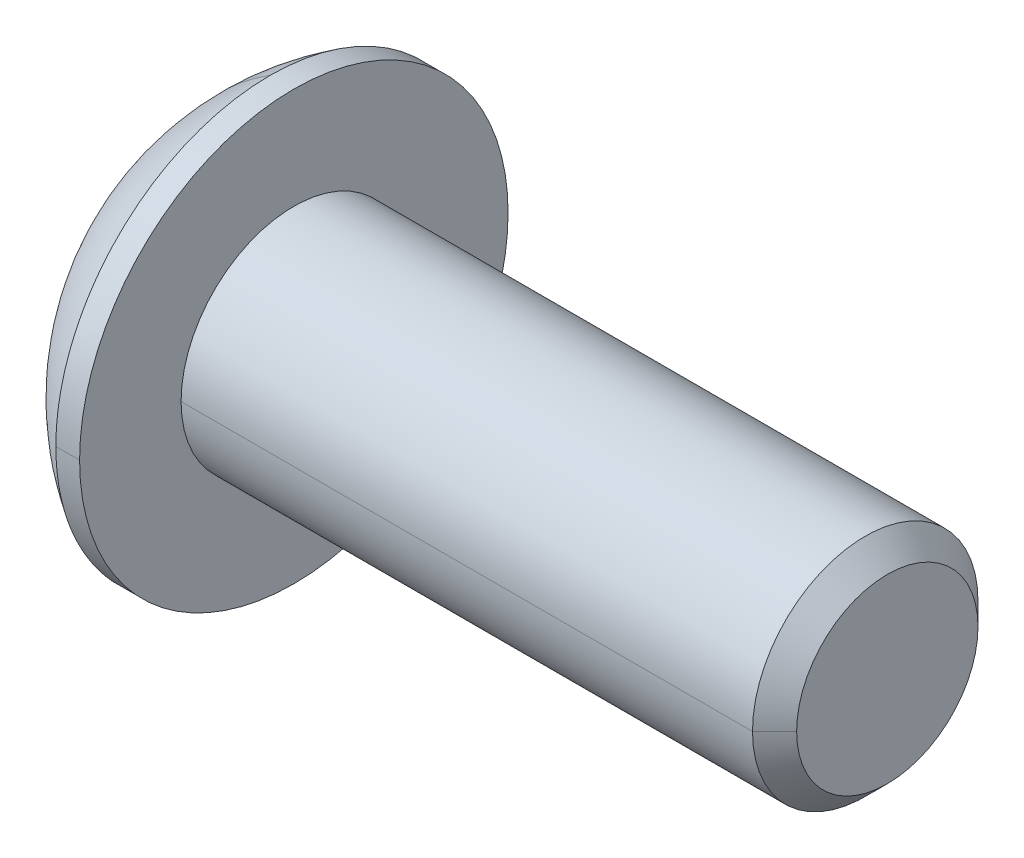
ISO-10303-21;
HEADER;
FILE_DESCRIPTION(('STEP AP214'),'2;1');
FILE_NAME('part.step','',(''),(''),'','','');
FILE_SCHEMA(('AUTOMOTIVE_DESIGN { 1 0 10303 214 1 1 1 1 }'));
ENDSEC;
DATA;
#1=APPLICATION_CONTEXT('core data for automotive mechanical design processes');
#2=APPLICATION_PROTOCOL_DEFINITION('international standard','automotive_design',2000,#1);
#3=PRODUCT_CONTEXT('',#1,'mechanical');
#4=PRODUCT('Part','Part','',(#3));
#5=PRODUCT_RELATED_PRODUCT_CATEGORY('part','',(#4));
#6=PRODUCT_DEFINITION_FORMATION('','',#4);
#7=PRODUCT_DEFINITION_CONTEXT('part definition',#1,'design');
#8=PRODUCT_DEFINITION('design','',#6,#7);
#9=PRODUCT_DEFINITION_SHAPE('','',#8);
#10=(LENGTH_UNIT() NAMED_UNIT(*) SI_UNIT(.MILLI.,.METRE.));
#11=(NAMED_UNIT(*) PLANE_ANGLE_UNIT() SI_UNIT($,.RADIAN.));
#12=(NAMED_UNIT(*) SI_UNIT($,.STERADIAN.) SOLID_ANGLE_UNIT());
#13=UNCERTAINTY_MEASURE_WITH_UNIT(LENGTH_MEASURE(1.E-05),#10,'distance_accuracy_value','');
#14=(GEOMETRIC_REPRESENTATION_CONTEXT(3) GLOBAL_UNCERTAINTY_ASSIGNED_CONTEXT((#13)) GLOBAL_UNIT_ASSIGNED_CONTEXT((#10,
#11,#12)) REPRESENTATION_CONTEXT('',''));
#15=CARTESIAN_POINT('',(0.,0.,0.));
#16=DIRECTION('',(0.,0.,1.));
#17=DIRECTION('',(1.,0.,0.));
#18=AXIS2_PLACEMENT_3D('',#15,#16,#17);
#19=CARTESIAN_POINT('',(-997.305456447661,0.,0.));
#20=DIRECTION('',(-1.,0.,0.));
#21=DIRECTION('',(0.,0.,1.));
#22=AXIS2_PLACEMENT_3D('',#19,#20,#21);
#23=CONICAL_SURFACE('',#22,1732.05080756885,1.0471975511966);
#24=DIRECTION('',(-0.5,0.,0.866025403784436));
#25=VECTOR('',#24,1.);
#26=CARTESIAN_POINT('',(2.69454355233854,0.,0.));
#27=LINE('',#26,#25);
#28=CARTESIAN_POINT('',(2.69454355233854,0.,0.));
#29=VERTEX_POINT('',#28);
#30=CARTESIAN_POINT('',(1.778,0.,1.5875));
#31=VERTEX_POINT('',#30);
#32=EDGE_CURVE('E41',#29,#31,#27,.T.);
#33=ORIENTED_EDGE('',*,*,#32,.F.);
#34=DIRECTION('',(-0.5,0.,-0.866025403784436));
#35=VECTOR('',#34,1.);
#36=CARTESIAN_POINT('',(2.69454355233854,0.,0.));
#37=LINE('',#36,#35);
#38=CARTESIAN_POINT('',(1.778,0.,-1.5875));
#39=VERTEX_POINT('',#38);
#40=EDGE_CURVE('E11',#29,#39,#37,.T.);
#41=ORIENTED_EDGE('',*,*,#40,.T.);
#42=CARTESIAN_POINT('',(1.778,0.,0.));
#43=DIRECTION('',(-1.,0.,0.));
#44=DIRECTION('',(0.,0.,1.));
#45=AXIS2_PLACEMENT_3D('',#42,#43,#44);
#46=CIRCLE('',#45,1.5875);
#47=CARTESIAN_POINT('',(1.778,-1.3748153285078,-0.79375));
#48=VERTEX_POINT('',#47);
#49=EDGE_CURVE('E27',#39,#48,#46,.T.);
#50=ORIENTED_EDGE('',*,*,#49,.T.);
#51=CARTESIAN_POINT('',(1.778,0.,0.));
#52=DIRECTION('',(-1.,0.,0.));
#53=DIRECTION('',(0.,0.,1.));
#54=AXIS2_PLACEMENT_3D('',#51,#52,#53);
#55=CIRCLE('',#54,1.5875);
#56=CARTESIAN_POINT('',(1.778,-1.3748153285078,0.79375));
#57=VERTEX_POINT('',#56);
#58=EDGE_CURVE('E178',#48,#57,#55,.T.);
#59=ORIENTED_EDGE('',*,*,#58,.T.);
#60=CARTESIAN_POINT('',(1.778,0.,0.));
#61=DIRECTION('',(-1.,0.,0.));
#62=DIRECTION('',(0.,0.,1.));
#63=AXIS2_PLACEMENT_3D('',#60,#61,#62);
#64=CIRCLE('',#63,1.5875);
#65=EDGE_CURVE('E176',#57,#31,#64,.T.);
#66=ORIENTED_EDGE('',*,*,#65,.T.);
#67=EDGE_LOOP('',(#33,#41,#50,#59,#66));
#68=FACE_BOUND('',#67,.T.);
#69=ADVANCED_FACE('F16',(#68),#23,.F.);
#70=CARTESIAN_POINT('',(15.2654,0.,0.));
#71=DIRECTION('',(-1.,0.,0.));
#72=DIRECTION('',(0.,0.,1.));
#73=AXIS2_PLACEMENT_3D('',#70,#71,#72);
#74=CONICAL_SURFACE('',#73,1.94056,0.785398163397452);
#75=CARTESIAN_POINT('',(15.2654,0.,0.));
#76=DIRECTION('',(-1.,0.,0.));
#77=DIRECTION('',(0.,0.,1.));
#78=AXIS2_PLACEMENT_3D('',#75,#76,#77);
#79=CIRCLE('',#78,1.94056);
#80=CARTESIAN_POINT('',(15.2654,0.,1.94056));
#81=VERTEX_POINT('',#80);
#82=CARTESIAN_POINT('',(15.2654,0.,-1.94056));
#83=VERTEX_POINT('',#82);
#84=EDGE_CURVE('E179',#81,#83,#79,.T.);
#85=ORIENTED_EDGE('',*,*,#84,.T.);
#86=DIRECTION('',(-0.707106781186545,0.,-0.70710678118655));
#87=VECTOR('',#86,1.);
#88=CARTESIAN_POINT('',(15.2654,0.,-1.94056));
#89=LINE('',#88,#87);
#90=CARTESIAN_POINT('',(14.79296,0.,-2.413));
#91=VERTEX_POINT('',#90);
#92=EDGE_CURVE('E221',#83,#91,#89,.T.);
#93=ORIENTED_EDGE('',*,*,#92,.T.);
#94=CARTESIAN_POINT('',(14.79296,0.,0.));
#95=DIRECTION('',(-1.,0.,0.));
#96=DIRECTION('',(0.,0.,1.));
#97=AXIS2_PLACEMENT_3D('',#94,#95,#96);
#98=CIRCLE('',#97,2.413);
#99=CARTESIAN_POINT('',(14.79296,0.,2.413));
#100=VERTEX_POINT('',#99);
#101=EDGE_CURVE('E192',#100,#91,#98,.T.);
#102=ORIENTED_EDGE('',*,*,#101,.F.);
#103=DIRECTION('',(-0.707106781186545,0.,0.70710678118655));
#104=VECTOR('',#103,1.);
#105=CARTESIAN_POINT('',(15.2654,0.,1.94056));
#106=LINE('',#105,#104);
#107=EDGE_CURVE('E216',#81,#100,#106,.T.);
#108=ORIENTED_EDGE('',*,*,#107,.F.);
#109=EDGE_LOOP('',(#85,#93,#102,#108));
#110=FACE_BOUND('',#109,.T.);
#111=ADVANCED_FACE('F359',(#110),#74,.T.);
#112=CARTESIAN_POINT('',(0.,0.,0.));
#113=DIRECTION('',(-1.,0.,0.));
#114=DIRECTION('',(0.,0.,1.));
#115=AXIS2_PLACEMENT_3D('',#112,#113,#114);
#116=CYLINDRICAL_SURFACE('',#115,2.413);
#117=ORIENTED_EDGE('',*,*,#101,.T.);
#118=DIRECTION('',(-1.,0.,0.));
#119=VECTOR('',#118,1.);
#120=CARTESIAN_POINT('',(0.,0.,-2.413));
#121=LINE('',#120,#119);
#122=CARTESIAN_POINT('',(2.5654,0.,-2.413));
#123=VERTEX_POINT('',#122);
#124=EDGE_CURVE('E158',#91,#123,#121,.T.);
#125=ORIENTED_EDGE('',*,*,#124,.T.);
#126=CARTESIAN_POINT('',(2.5654,0.,0.));
#127=DIRECTION('',(-1.,0.,0.));
#128=DIRECTION('',(0.,0.,1.));
#129=AXIS2_PLACEMENT_3D('',#126,#127,#128);
#130=CIRCLE('',#129,2.413);
#131=CARTESIAN_POINT('',(2.5654,0.,2.413));
#132=VERTEX_POINT('',#131);
#133=EDGE_CURVE('E152',#132,#123,#130,.T.);
#134=ORIENTED_EDGE('',*,*,#133,.F.);
#135=DIRECTION('',(-1.,0.,0.));
#136=VECTOR('',#135,1.);
#137=CARTESIAN_POINT('',(0.,0.,2.413));
#138=LINE('',#137,#136);
#139=EDGE_CURVE('E215',#100,#132,#138,.T.);
#140=ORIENTED_EDGE('',*,*,#139,.F.);
#141=EDGE_LOOP('',(#117,#125,#134,#140));
#142=FACE_BOUND('',#141,.T.);
#143=ADVANCED_FACE('F758',(#142),#116,.T.);
#144=CARTESIAN_POINT('',(0.,0.,0.));
#145=DIRECTION('',(-1.,0.,0.));
#146=DIRECTION('',(0.,0.,1.));
#147=AXIS2_PLACEMENT_3D('',#144,#145,#146);
#148=CYLINDRICAL_SURFACE('',#147,4.5847);
#149=CARTESIAN_POINT('',(2.5654,0.,0.));
#150=DIRECTION('',(-1.,0.,0.));
#151=DIRECTION('',(0.,0.,1.));
#152=AXIS2_PLACEMENT_3D('',#149,#150,#151);
#153=CIRCLE('',#152,4.5847);
#154=CARTESIAN_POINT('',(2.5654,0.,4.5847));
#155=VERTEX_POINT('',#154);
#156=CARTESIAN_POINT('',(2.5654,0.,-4.5847));
#157=VERTEX_POINT('',#156);
#158=EDGE_CURVE('E142',#155,#157,#153,.T.);
#159=ORIENTED_EDGE('',*,*,#158,.T.);
#160=DIRECTION('',(-1.,0.,0.));
#161=VECTOR('',#160,1.);
#162=CARTESIAN_POINT('',(0.,0.,-4.5847));
#163=LINE('',#162,#161);
#164=CARTESIAN_POINT('',(2.0574,0.,-4.5847));
#165=VERTEX_POINT('',#164);
#166=EDGE_CURVE('E159',#157,#165,#163,.T.);
#167=ORIENTED_EDGE('',*,*,#166,.T.);
#168=CARTESIAN_POINT('',(2.0574,0.,0.));
#169=DIRECTION('',(-1.,0.,0.));
#170=DIRECTION('',(0.,0.,1.));
#171=AXIS2_PLACEMENT_3D('',#168,#169,#170);
#172=CIRCLE('',#171,4.5847);
#173=CARTESIAN_POINT('',(2.0574,4.5847,0.));
#174=VERTEX_POINT('',#173);
#175=EDGE_CURVE('E325',#174,#165,#172,.T.);
#176=ORIENTED_EDGE('',*,*,#175,.F.);
#177=CARTESIAN_POINT('',(2.0574,0.,0.));
#178=DIRECTION('',(-1.,0.,0.));
#179=DIRECTION('',(0.,0.,1.));
#180=AXIS2_PLACEMENT_3D('',#177,#178,#179);
#181=CIRCLE('',#180,4.5847);
#182=CARTESIAN_POINT('',(2.0574,0.,4.5847));
#183=VERTEX_POINT('',#182);
#184=EDGE_CURVE('E145',#183,#174,#181,.T.);
#185=ORIENTED_EDGE('',*,*,#184,.F.);
#186=DIRECTION('',(-1.,0.,0.));
#187=VECTOR('',#186,1.);
#188=CARTESIAN_POINT('',(0.,0.,4.5847));
#189=LINE('',#188,#187);
#190=EDGE_CURVE('E138',#155,#183,#189,.T.);
#191=ORIENTED_EDGE('',*,*,#190,.F.);
#192=EDGE_LOOP('',(#159,#167,#176,#185,#191));
#193=FACE_BOUND('',#192,.T.);
#194=ADVANCED_FACE('F140',(#193),#148,.T.);
#195=CARTESIAN_POINT('',(4.85989606481482,0.,0.));
#196=DIRECTION('',(0.,0.,-1.));
#197=DIRECTION('',(0.,1.,0.));
#198=AXIS2_PLACEMENT_3D('',#195,#196,#197);
#199=SPHERICAL_SURFACE('',#198,5.37340285883188);
#200=ORIENTED_EDGE('',*,*,#175,.T.);
#201=CARTESIAN_POINT('',(2.0574,0.,0.));
#202=DIRECTION('',(-1.,0.,0.));
#203=DIRECTION('',(0.,0.,1.));
#204=AXIS2_PLACEMENT_3D('',#201,#202,#203);
#205=CIRCLE('',#204,4.5847);
#206=CARTESIAN_POINT('',(2.0574,-4.5847,0.));
#207=VERTEX_POINT('',#206);
#208=EDGE_CURVE('E247',#165,#207,#205,.T.);
#209=ORIENTED_EDGE('',*,*,#208,.T.);
#210=CARTESIAN_POINT('',(4.85989606481482,0.,0.));
#211=DIRECTION('',(0.,0.,-1.));
#212=DIRECTION('',(0.,1.,0.));
#213=AXIS2_PLACEMENT_3D('',#210,#211,#212);
#214=CIRCLE('',#213,5.37340285883188);
#215=CARTESIAN_POINT('',(0.,-2.29235,0.));
#216=VERTEX_POINT('',#215);
#217=EDGE_CURVE('E244',#207,#216,#214,.T.);
#218=ORIENTED_EDGE('',*,*,#217,.T.);
#219=CARTESIAN_POINT('',(0.,0.,0.));
#220=DIRECTION('',(-1.,0.,0.));
#221=DIRECTION('',(0.,0.,1.));
#222=AXIS2_PLACEMENT_3D('',#219,#220,#221);
#223=CIRCLE('',#222,2.29235);
#224=CARTESIAN_POINT('',(0.,2.29235,0.));
#225=VERTEX_POINT('',#224);
#226=EDGE_CURVE('E248',#225,#216,#223,.T.);
#227=ORIENTED_EDGE('',*,*,#226,.F.);
#228=CARTESIAN_POINT('',(4.85989606481482,0.,0.));
#229=DIRECTION('',(0.,0.,1.));
#230=DIRECTION('',(1.,0.,0.));
#231=AXIS2_PLACEMENT_3D('',#228,#229,#230);
#232=CIRCLE('',#231,5.37340285883188);
#233=EDGE_CURVE('E164',#174,#225,#232,.T.);
#234=ORIENTED_EDGE('',*,*,#233,.F.);
#235=EDGE_LOOP('',(#200,#209,#218,#227,#234));
#236=FACE_BOUND('',#235,.T.);
#237=ADVANCED_FACE('F738',(#236),#199,.T.);
#238=CARTESIAN_POINT('',(0.,0.,0.));
#239=DIRECTION('',(-1.,0.,0.));
#240=DIRECTION('',(0.,0.,1.));
#241=AXIS2_PLACEMENT_3D('',#238,#239,#240);
#242=PLANE('',#241);
#243=ORIENTED_EDGE('',*,*,#226,.T.);
#244=CARTESIAN_POINT('',(0.,0.,0.));
#245=DIRECTION('',(-1.,0.,0.));
#246=DIRECTION('',(0.,0.,1.));
#247=AXIS2_PLACEMENT_3D('',#244,#245,#246);
#248=CIRCLE('',#247,2.29235);
#249=EDGE_CURVE('E315',#216,#225,#248,.T.);
#250=ORIENTED_EDGE('',*,*,#249,.T.);
#251=EDGE_LOOP('',(#243,#250));
#252=FACE_BOUND('',#251,.T.);
#253=DIRECTION('',(0.,-1.,0.));
#254=VECTOR('',#253,1.);
#255=CARTESIAN_POINT('',(0.,-0.916543552338531,1.5875));
#256=LINE('',#255,#254);
#257=CARTESIAN_POINT('',(0.,0.916543552338531,1.5875));
#258=VERTEX_POINT('',#257);
#259=CARTESIAN_POINT('',(0.,-0.916543552338531,1.5875));
#260=VERTEX_POINT('',#259);
#261=EDGE_CURVE('E301',#258,#260,#256,.T.);
#262=ORIENTED_EDGE('',*,*,#261,.T.);
#263=DIRECTION('',(0.,-0.5,-0.866025403784439));
#264=VECTOR('',#263,1.);
#265=CARTESIAN_POINT('',(0.,-1.83308710467706,0.));
#266=LINE('',#265,#264);
#267=CARTESIAN_POINT('',(0.,-1.83308710467706,0.));
#268=VERTEX_POINT('',#267);
#269=EDGE_CURVE('E297',#260,#268,#266,.T.);
#270=ORIENTED_EDGE('',*,*,#269,.T.);
#271=DIRECTION('',(0.,0.5,-0.866025403784439));
#272=VECTOR('',#271,1.);
#273=CARTESIAN_POINT('',(0.,-0.916543552338531,-1.5875));
#274=LINE('',#273,#272);
#275=CARTESIAN_POINT('',(0.,-0.916543552338531,-1.5875));
#276=VERTEX_POINT('',#275);
#277=EDGE_CURVE('E228',#268,#276,#274,.T.);
#278=ORIENTED_EDGE('',*,*,#277,.T.);
#279=DIRECTION('',(0.,1.,0.));
#280=VECTOR('',#279,1.);
#281=CARTESIAN_POINT('',(0.,0.916543552338531,-1.5875));
#282=LINE('',#281,#280);
#283=CARTESIAN_POINT('',(0.,0.916543552338531,-1.5875));
#284=VERTEX_POINT('',#283);
#285=EDGE_CURVE('E197',#276,#284,#282,.T.);
#286=ORIENTED_EDGE('',*,*,#285,.T.);
#287=DIRECTION('',(0.,0.5,0.866025403784439));
#288=VECTOR('',#287,1.);
#289=CARTESIAN_POINT('',(0.,1.83308710467706,0.));
#290=LINE('',#289,#288);
#291=CARTESIAN_POINT('',(0.,1.83308710467706,0.));
#292=VERTEX_POINT('',#291);
#293=EDGE_CURVE('E193',#284,#292,#290,.T.);
#294=ORIENTED_EDGE('',*,*,#293,.T.);
#295=DIRECTION('',(0.,-0.5,0.866025403784439));
#296=VECTOR('',#295,1.);
#297=CARTESIAN_POINT('',(0.,0.916543552338531,1.5875));
#298=LINE('',#297,#296);
#299=EDGE_CURVE('E198',#292,#258,#298,.T.);
#300=ORIENTED_EDGE('',*,*,#299,.T.);
#301=EDGE_LOOP('',(#262,#270,#278,#286,#294,#300));
#302=FACE_BOUND('',#301,.T.);
#303=ADVANCED_FACE('F742',(#252,#302),#242,.T.);
#304=CARTESIAN_POINT('',(4.85989606481482,0.,0.));
#305=DIRECTION('',(0.,0.,-1.));
#306=DIRECTION('',(0.,1.,0.));
#307=AXIS2_PLACEMENT_3D('',#304,#305,#306);
#308=SPHERICAL_SURFACE('',#307,5.37340285883188);
#309=ORIENTED_EDGE('',*,*,#217,.F.);
#310=CARTESIAN_POINT('',(2.0574,0.,0.));
#311=DIRECTION('',(-1.,0.,0.));
#312=DIRECTION('',(0.,0.,1.));
#313=AXIS2_PLACEMENT_3D('',#310,#311,#312);
#314=CIRCLE('',#313,4.5847);
#315=EDGE_CURVE('E201',#207,#183,#314,.T.);
#316=ORIENTED_EDGE('',*,*,#315,.T.);
#317=ORIENTED_EDGE('',*,*,#184,.T.);
#318=ORIENTED_EDGE('',*,*,#233,.T.);
#319=ORIENTED_EDGE('',*,*,#249,.F.);
#320=EDGE_LOOP('',(#309,#316,#317,#318,#319));
#321=FACE_BOUND('',#320,.T.);
#322=ADVANCED_FACE('F790',(#321),#308,.T.);
#323=CARTESIAN_POINT('',(0.,0.,0.));
#324=DIRECTION('',(-1.,0.,0.));
#325=DIRECTION('',(0.,0.,1.));
#326=AXIS2_PLACEMENT_3D('',#323,#324,#325);
#327=CYLINDRICAL_SURFACE('',#326,4.5847);
#328=ORIENTED_EDGE('',*,*,#166,.F.);
#329=CARTESIAN_POINT('',(2.5654,0.,0.));
#330=DIRECTION('',(-1.,0.,0.));
#331=DIRECTION('',(0.,0.,1.));
#332=AXIS2_PLACEMENT_3D('',#329,#330,#331);
#333=CIRCLE('',#332,4.5847);
#334=EDGE_CURVE('E151',#157,#155,#333,.T.);
#335=ORIENTED_EDGE('',*,*,#334,.T.);
#336=ORIENTED_EDGE('',*,*,#190,.T.);
#337=ORIENTED_EDGE('',*,*,#315,.F.);
#338=ORIENTED_EDGE('',*,*,#208,.F.);
#339=EDGE_LOOP('',(#328,#335,#336,#337,#338));
#340=FACE_BOUND('',#339,.T.);
#341=ADVANCED_FACE('F161',(#340),#327,.T.);
#342=CARTESIAN_POINT('',(2.5654,2.413,0.));
#343=DIRECTION('',(-1.,0.,0.));
#344=DIRECTION('',(0.,0.,1.));
#345=AXIS2_PLACEMENT_3D('',#342,#343,#344);
#346=PLANE('',#345);
#347=ORIENTED_EDGE('',*,*,#158,.F.);
#348=ORIENTED_EDGE('',*,*,#334,.F.);
#349=EDGE_LOOP('',(#347,#348));
#350=FACE_BOUND('',#349,.T.);
#351=ORIENTED_EDGE('',*,*,#133,.T.);
#352=CARTESIAN_POINT('',(2.5654,0.,0.));
#353=DIRECTION('',(-1.,0.,0.));
#354=DIRECTION('',(0.,0.,1.));
#355=AXIS2_PLACEMENT_3D('',#352,#353,#354);
#356=CIRCLE('',#355,2.413);
#357=EDGE_CURVE('E229',#123,#132,#356,.T.);
#358=ORIENTED_EDGE('',*,*,#357,.T.);
#359=EDGE_LOOP('',(#351,#358));
#360=FACE_BOUND('',#359,.T.);
#361=ADVANCED_FACE('F155',(#350,#360),#346,.F.);
#362=CARTESIAN_POINT('',(0.,0.,0.));
#363=DIRECTION('',(-1.,0.,0.));
#364=DIRECTION('',(0.,0.,1.));
#365=AXIS2_PLACEMENT_3D('',#362,#363,#364);
#366=CYLINDRICAL_SURFACE('',#365,2.413);
#367=ORIENTED_EDGE('',*,*,#124,.F.);
#368=CARTESIAN_POINT('',(14.79296,0.,0.));
#369=DIRECTION('',(-1.,0.,0.));
#370=DIRECTION('',(0.,0.,1.));
#371=AXIS2_PLACEMENT_3D('',#368,#369,#370);
#372=CIRCLE('',#371,2.413);
#373=EDGE_CURVE('E233',#91,#100,#372,.T.);
#374=ORIENTED_EDGE('',*,*,#373,.T.);
#375=ORIENTED_EDGE('',*,*,#139,.T.);
#376=ORIENTED_EDGE('',*,*,#357,.F.);
#377=EDGE_LOOP('',(#367,#374,#375,#376));
#378=FACE_BOUND('',#377,.T.);
#379=ADVANCED_FACE('F813',(#378),#366,.T.);
#380=CARTESIAN_POINT('',(15.2654,0.,0.));
#381=DIRECTION('',(-1.,0.,0.));
#382=DIRECTION('',(0.,0.,1.));
#383=AXIS2_PLACEMENT_3D('',#380,#381,#382);
#384=CONICAL_SURFACE('',#383,1.94056,0.785398163397452);
#385=ORIENTED_EDGE('',*,*,#92,.F.);
#386=CARTESIAN_POINT('',(15.2654,0.,0.));
#387=DIRECTION('',(-1.,0.,0.));
#388=DIRECTION('',(0.,0.,1.));
#389=AXIS2_PLACEMENT_3D('',#386,#387,#388);
#390=CIRCLE('',#389,1.94056);
#391=EDGE_CURVE('E212',#83,#81,#390,.T.);
#392=ORIENTED_EDGE('',*,*,#391,.T.);
#393=ORIENTED_EDGE('',*,*,#107,.T.);
#394=ORIENTED_EDGE('',*,*,#373,.F.);
#395=EDGE_LOOP('',(#385,#392,#393,#394));
#396=FACE_BOUND('',#395,.T.);
#397=ADVANCED_FACE('F366',(#396),#384,.T.);
#398=CARTESIAN_POINT('',(15.2654,0.,0.));
#399=DIRECTION('',(-1.,0.,0.));
#400=DIRECTION('',(0.,0.,1.));
#401=AXIS2_PLACEMENT_3D('',#398,#399,#400);
#402=PLANE('',#401);
#403=ORIENTED_EDGE('',*,*,#84,.F.);
#404=ORIENTED_EDGE('',*,*,#391,.F.);
#405=EDGE_LOOP('',(#403,#404));
#406=FACE_BOUND('',#405,.T.);
#407=ADVANCED_FACE('F365',(#406),#402,.F.);
#408=CARTESIAN_POINT('',(1.778,-1.83308710467706,0.));
#409=DIRECTION('',(0.,0.866025403784439,-0.5));
#410=DIRECTION('',(-1.,0.,0.));
#411=AXIS2_PLACEMENT_3D('',#408,#409,#410);
#412=PLANE('',#411);
#413=DIRECTION('',(0.,-0.5,-0.866025403784439));
#414=VECTOR('',#413,1.);
#415=CARTESIAN_POINT('',(1.778,-1.83308710467706,0.));
#416=LINE('',#415,#414);
#417=CARTESIAN_POINT('',(1.778,-0.916543552338531,1.5875));
#418=VERTEX_POINT('',#417);
#419=EDGE_CURVE('E20',#418,#57,#416,.T.);
#420=ORIENTED_EDGE('',*,*,#419,.T.);
#421=DIRECTION('',(0.,-0.5,-0.866025403784439));
#422=VECTOR('',#421,1.);
#423=CARTESIAN_POINT('',(1.778,-1.83308710467706,0.));
#424=LINE('',#423,#422);
#425=CARTESIAN_POINT('',(1.778,-1.83308710467706,0.));
#426=VERTEX_POINT('',#425);
#427=EDGE_CURVE('E258',#57,#426,#424,.T.);
#428=ORIENTED_EDGE('',*,*,#427,.T.);
#429=DIRECTION('',(-1.,0.,0.));
#430=VECTOR('',#429,1.);
#431=CARTESIAN_POINT('',(1.778,-1.83308710467706,0.));
#432=LINE('',#431,#430);
#433=EDGE_CURVE('E268',#426,#268,#432,.T.);
#434=ORIENTED_EDGE('',*,*,#433,.T.);
#435=ORIENTED_EDGE('',*,*,#269,.F.);
#436=DIRECTION('',(-1.,0.,0.));
#437=VECTOR('',#436,1.);
#438=CARTESIAN_POINT('',(1.778,-0.916543552338531,1.5875));
#439=LINE('',#438,#437);
#440=EDGE_CURVE('E174',#418,#260,#439,.T.);
#441=ORIENTED_EDGE('',*,*,#440,.F.);
#442=EDGE_LOOP('',(#420,#428,#434,#435,#441));
#443=FACE_BOUND('',#442,.T.);
#444=ADVANCED_FACE('F392',(#443),#412,.T.);
#445=CARTESIAN_POINT('',(1.778,-0.916543552338531,-1.5875));
#446=DIRECTION('',(0.,0.866025403784439,0.5));
#447=DIRECTION('',(1.,0.,0.));
#448=AXIS2_PLACEMENT_3D('',#445,#446,#447);
#449=PLANE('',#448);
#450=DIRECTION('',(0.,0.5,-0.866025403784439));
#451=VECTOR('',#450,1.);
#452=CARTESIAN_POINT('',(1.778,-0.916543552338531,-1.5875));
#453=LINE('',#452,#451);
#454=EDGE_CURVE('E184',#426,#48,#453,.T.);
#455=ORIENTED_EDGE('',*,*,#454,.T.);
#456=DIRECTION('',(0.,0.5,-0.866025403784439));
#457=VECTOR('',#456,1.);
#458=CARTESIAN_POINT('',(1.778,-0.916543552338531,-1.5875));
#459=LINE('',#458,#457);
#460=CARTESIAN_POINT('',(1.778,-0.916543552338531,-1.5875));
#461=VERTEX_POINT('',#460);
#462=EDGE_CURVE('E180',#48,#461,#459,.T.);
#463=ORIENTED_EDGE('',*,*,#462,.T.);
#464=DIRECTION('',(-1.,0.,0.));
#465=VECTOR('',#464,1.);
#466=CARTESIAN_POINT('',(1.778,-0.916543552338531,-1.5875));
#467=LINE('',#466,#465);
#468=EDGE_CURVE('E185',#461,#276,#467,.T.);
#469=ORIENTED_EDGE('',*,*,#468,.T.);
#470=ORIENTED_EDGE('',*,*,#277,.F.);
#471=ORIENTED_EDGE('',*,*,#433,.F.);
#472=EDGE_LOOP('',(#455,#463,#469,#470,#471));
#473=FACE_BOUND('',#472,.T.);
#474=ADVANCED_FACE('F417',(#473),#449,.T.);
#475=CARTESIAN_POINT('',(1.778,0.916543552338531,-1.5875));
#476=DIRECTION('',(0.,0.,1.));
#477=DIRECTION('',(1.,0.,0.));
#478=AXIS2_PLACEMENT_3D('',#475,#476,#477);
#479=PLANE('',#478);
#480=DIRECTION('',(0.,1.,0.));
#481=VECTOR('',#480,1.);
#482=CARTESIAN_POINT('',(1.778,0.916543552338531,-1.5875));
#483=LINE('',#482,#481);
#484=EDGE_CURVE('E293',#461,#39,#483,.T.);
#485=ORIENTED_EDGE('',*,*,#484,.T.);
#486=DIRECTION('',(0.,1.,0.));
#487=VECTOR('',#486,1.);
#488=CARTESIAN_POINT('',(1.778,0.916543552338531,-1.5875));
#489=LINE('',#488,#487);
#490=CARTESIAN_POINT('',(1.778,0.916543552338531,-1.5875));
#491=VERTEX_POINT('',#490);
#492=EDGE_CURVE('E289',#39,#491,#489,.T.);
#493=ORIENTED_EDGE('',*,*,#492,.T.);
#494=DIRECTION('',(-1.,0.,0.));
#495=VECTOR('',#494,1.);
#496=CARTESIAN_POINT('',(1.778,0.916543552338531,-1.5875));
#497=LINE('',#496,#495);
#498=EDGE_CURVE('E294',#491,#284,#497,.T.);
#499=ORIENTED_EDGE('',*,*,#498,.T.);
#500=ORIENTED_EDGE('',*,*,#285,.F.);
#501=ORIENTED_EDGE('',*,*,#468,.F.);
#502=EDGE_LOOP('',(#485,#493,#499,#500,#501));
#503=FACE_BOUND('',#502,.T.);
#504=ADVANCED_FACE('F763',(#503),#479,.T.);
#505=CARTESIAN_POINT('',(1.778,1.83308710467706,0.));
#506=DIRECTION('',(0.,-0.866025403784439,0.5));
#507=DIRECTION('',(-1.,0.,0.));
#508=AXIS2_PLACEMENT_3D('',#505,#506,#507);
#509=PLANE('',#508);
#510=DIRECTION('',(0.,0.5,0.866025403784439));
#511=VECTOR('',#510,1.);
#512=CARTESIAN_POINT('',(1.778,1.83308710467706,0.));
#513=LINE('',#512,#511);
#514=CARTESIAN_POINT('',(1.778,1.3748153285078,-0.79375));
#515=VERTEX_POINT('',#514);
#516=EDGE_CURVE('E310',#491,#515,#513,.T.);
#517=ORIENTED_EDGE('',*,*,#516,.T.);
#518=DIRECTION('',(0.,0.5,0.866025403784439));
#519=VECTOR('',#518,1.);
#520=CARTESIAN_POINT('',(1.778,1.83308710467706,0.));
#521=LINE('',#520,#519);
#522=CARTESIAN_POINT('',(1.778,1.83308710467706,0.));
#523=VERTEX_POINT('',#522);
#524=EDGE_CURVE('E306',#515,#523,#521,.T.);
#525=ORIENTED_EDGE('',*,*,#524,.T.);
#526=DIRECTION('',(-1.,0.,0.));
#527=VECTOR('',#526,1.);
#528=CARTESIAN_POINT('',(1.778,1.83308710467706,0.));
#529=LINE('',#528,#527);
#530=EDGE_CURVE('E311',#523,#292,#529,.T.);
#531=ORIENTED_EDGE('',*,*,#530,.T.);
#532=ORIENTED_EDGE('',*,*,#293,.F.);
#533=ORIENTED_EDGE('',*,*,#498,.F.);
#534=EDGE_LOOP('',(#517,#525,#531,#532,#533));
#535=FACE_BOUND('',#534,.T.);
#536=ADVANCED_FACE('F567',(#535),#509,.T.);
#537=CARTESIAN_POINT('',(1.778,0.916543552338531,1.5875));
#538=DIRECTION('',(0.,-0.866025403784439,-0.5));
#539=DIRECTION('',(0.,0.5,-0.866025403784439));
#540=AXIS2_PLACEMENT_3D('',#537,#538,#539);
#541=PLANE('',#540);
#542=DIRECTION('',(0.,-0.5,0.866025403784439));
#543=VECTOR('',#542,1.);
#544=CARTESIAN_POINT('',(1.778,0.916543552338531,1.5875));
#545=LINE('',#544,#543);
#546=CARTESIAN_POINT('',(1.778,1.3748153285078,0.79375));
#547=VERTEX_POINT('',#546);
#548=EDGE_CURVE('E281',#523,#547,#545,.T.);
#549=ORIENTED_EDGE('',*,*,#548,.T.);
#550=DIRECTION('',(0.,-0.5,0.866025403784439));
#551=VECTOR('',#550,1.);
#552=CARTESIAN_POINT('',(1.778,0.916543552338531,1.5875));
#553=LINE('',#552,#551);
#554=CARTESIAN_POINT('',(1.778,0.916543552338531,1.5875));
#555=VERTEX_POINT('',#554);
#556=EDGE_CURVE('E305',#547,#555,#553,.T.);
#557=ORIENTED_EDGE('',*,*,#556,.T.);
#558=DIRECTION('',(-1.,0.,0.));
#559=VECTOR('',#558,1.);
#560=CARTESIAN_POINT('',(1.778,0.916543552338531,1.5875));
#561=LINE('',#560,#559);
#562=EDGE_CURVE('E288',#555,#258,#561,.T.);
#563=ORIENTED_EDGE('',*,*,#562,.T.);
#564=ORIENTED_EDGE('',*,*,#299,.F.);
#565=ORIENTED_EDGE('',*,*,#530,.F.);
#566=EDGE_LOOP('',(#549,#557,#563,#564,#565));
#567=FACE_BOUND('',#566,.T.);
#568=ADVANCED_FACE('F18',(#567),#541,.T.);
#569=CARTESIAN_POINT('',(1.778,-0.916543552338531,1.5875));
#570=DIRECTION('',(0.,0.,-1.));
#571=DIRECTION('',(-1.,0.,0.));
#572=AXIS2_PLACEMENT_3D('',#569,#570,#571);
#573=PLANE('',#572);
#574=DIRECTION('',(0.,-1.,0.));
#575=VECTOR('',#574,1.);
#576=CARTESIAN_POINT('',(1.778,-0.916543552338531,1.5875));
#577=LINE('',#576,#575);
#578=EDGE_CURVE('E211',#555,#31,#577,.T.);
#579=ORIENTED_EDGE('',*,*,#578,.T.);
#580=DIRECTION('',(0.,-1.,0.));
#581=VECTOR('',#580,1.);
#582=CARTESIAN_POINT('',(1.778,-0.916543552338531,1.5875));
#583=LINE('',#582,#581);
#584=EDGE_CURVE('E207',#31,#418,#583,.T.);
#585=ORIENTED_EDGE('',*,*,#584,.T.);
#586=ORIENTED_EDGE('',*,*,#440,.T.);
#587=ORIENTED_EDGE('',*,*,#261,.F.);
#588=ORIENTED_EDGE('',*,*,#562,.F.);
#589=EDGE_LOOP('',(#579,#585,#586,#587,#588));
#590=FACE_BOUND('',#589,.T.);
#591=ADVANCED_FACE('F398',(#590),#573,.T.);
#592=CARTESIAN_POINT('',(1.778,-2.74963065701559,-1.5875));
#593=DIRECTION('',(1.,0.,0.));
#594=DIRECTION('',(0.,1.,0.));
#595=AXIS2_PLACEMENT_3D('',#592,#593,#594);
#596=PLANE('',#595);
#597=CARTESIAN_POINT('',(1.778,0.,0.));
#598=DIRECTION('',(-1.,0.,0.));
#599=DIRECTION('',(0.,0.,1.));
#600=AXIS2_PLACEMENT_3D('',#597,#598,#599);
#601=CIRCLE('',#600,1.5875);
#602=EDGE_CURVE('E202',#515,#39,#601,.T.);
#603=ORIENTED_EDGE('',*,*,#602,.F.);
#604=ORIENTED_EDGE('',*,*,#516,.F.);
#605=ORIENTED_EDGE('',*,*,#492,.F.);
#606=EDGE_LOOP('',(#603,#604,#605));
#607=FACE_BOUND('',#606,.T.);
#608=ADVANCED_FACE('F561',(#607),#596,.F.);
#609=CARTESIAN_POINT('',(1.778,-2.74963065701559,-1.5875));
#610=DIRECTION('',(1.,0.,0.));
#611=DIRECTION('',(0.,1.,0.));
#612=AXIS2_PLACEMENT_3D('',#609,#610,#611);
#613=PLANE('',#612);
#614=CARTESIAN_POINT('',(1.778,0.,0.));
#615=DIRECTION('',(-1.,0.,0.));
#616=DIRECTION('',(0.,0.,1.));
#617=AXIS2_PLACEMENT_3D('',#614,#615,#616);
#618=CIRCLE('',#617,1.5875);
#619=EDGE_CURVE('E206',#547,#515,#618,.T.);
#620=ORIENTED_EDGE('',*,*,#619,.F.);
#621=ORIENTED_EDGE('',*,*,#548,.F.);
#622=ORIENTED_EDGE('',*,*,#524,.F.);
#623=EDGE_LOOP('',(#620,#621,#622));
#624=FACE_BOUND('',#623,.T.);
#625=ADVANCED_FACE('F565',(#624),#613,.F.);
#626=CARTESIAN_POINT('',(1.778,-2.74963065701559,-1.5875));
#627=DIRECTION('',(1.,0.,0.));
#628=DIRECTION('',(0.,1.,0.));
#629=AXIS2_PLACEMENT_3D('',#626,#627,#628);
#630=PLANE('',#629);
#631=CARTESIAN_POINT('',(1.778,0.,0.));
#632=DIRECTION('',(-1.,0.,0.));
#633=DIRECTION('',(0.,0.,1.));
#634=AXIS2_PLACEMENT_3D('',#631,#632,#633);
#635=CIRCLE('',#634,1.5875);
#636=EDGE_CURVE('E240',#31,#547,#635,.T.);
#637=ORIENTED_EDGE('',*,*,#636,.F.);
#638=ORIENTED_EDGE('',*,*,#578,.F.);
#639=ORIENTED_EDGE('',*,*,#556,.F.);
#640=EDGE_LOOP('',(#637,#638,#639));
#641=FACE_BOUND('',#640,.T.);
#642=ADVANCED_FACE('F405',(#641),#630,.F.);
#643=CARTESIAN_POINT('',(1.778,-2.74963065701559,-1.5875));
#644=DIRECTION('',(1.,0.,0.));
#645=DIRECTION('',(0.,1.,0.));
#646=AXIS2_PLACEMENT_3D('',#643,#644,#645);
#647=PLANE('',#646);
#648=ORIENTED_EDGE('',*,*,#65,.F.);
#649=ORIENTED_EDGE('',*,*,#419,.F.);
#650=ORIENTED_EDGE('',*,*,#584,.F.);
#651=EDGE_LOOP('',(#648,#649,#650));
#652=FACE_BOUND('',#651,.T.);
#653=ADVANCED_FACE('F397',(#652),#647,.F.);
#654=CARTESIAN_POINT('',(1.778,-2.74963065701559,-1.5875));
#655=DIRECTION('',(1.,0.,0.));
#656=DIRECTION('',(0.,1.,0.));
#657=AXIS2_PLACEMENT_3D('',#654,#655,#656);
#658=PLANE('',#657);
#659=ORIENTED_EDGE('',*,*,#58,.F.);
#660=ORIENTED_EDGE('',*,*,#454,.F.);
#661=ORIENTED_EDGE('',*,*,#427,.F.);
#662=EDGE_LOOP('',(#659,#660,#661));
#663=FACE_BOUND('',#662,.T.);
#664=ADVANCED_FACE('F419',(#663),#658,.F.);
#665=CARTESIAN_POINT('',(1.778,-2.74963065701559,-1.5875));
#666=DIRECTION('',(1.,0.,0.));
#667=DIRECTION('',(0.,1.,0.));
#668=AXIS2_PLACEMENT_3D('',#665,#666,#667);
#669=PLANE('',#668);
#670=ORIENTED_EDGE('',*,*,#49,.F.);
#671=ORIENTED_EDGE('',*,*,#484,.F.);
#672=ORIENTED_EDGE('',*,*,#462,.F.);
#673=EDGE_LOOP('',(#670,#671,#672));
#674=FACE_BOUND('',#673,.T.);
#675=ADVANCED_FACE('F415',(#674),#669,.F.);
#676=CARTESIAN_POINT('',(-997.305456447661,0.,0.));
#677=DIRECTION('',(-1.,0.,0.));
#678=DIRECTION('',(0.,0.,1.));
#679=AXIS2_PLACEMENT_3D('',#676,#677,#678);
#680=CONICAL_SURFACE('',#679,1732.05080756885,1.0471975511966);
#681=ORIENTED_EDGE('',*,*,#40,.F.);
#682=ORIENTED_EDGE('',*,*,#32,.T.);
#683=ORIENTED_EDGE('',*,*,#636,.T.);
#684=ORIENTED_EDGE('',*,*,#619,.T.);
#685=ORIENTED_EDGE('',*,*,#602,.T.);
#686=EDGE_LOOP('',(#681,#682,#683,#684,#685));
#687=FACE_BOUND('',#686,.T.);
#688=ADVANCED_FACE('F409',(#687),#680,.F.);
#689=CLOSED_SHELL('',(#69,#111,#143,#194,#237,#303,#322,#341,#361,#379,#397,#407,#444,#474,#504,
#536,#568,#591,#608,#625,#642,#653,#664,#675,#688));
#690=MANIFOLD_SOLID_BREP('B1',#689);
#691=ADVANCED_BREP_SHAPE_REPRESENTATION('',(#18,#690),#14);
#692=SHAPE_DEFINITION_REPRESENTATION(#9,#691);
ENDSEC;
END-ISO-10303-21;
